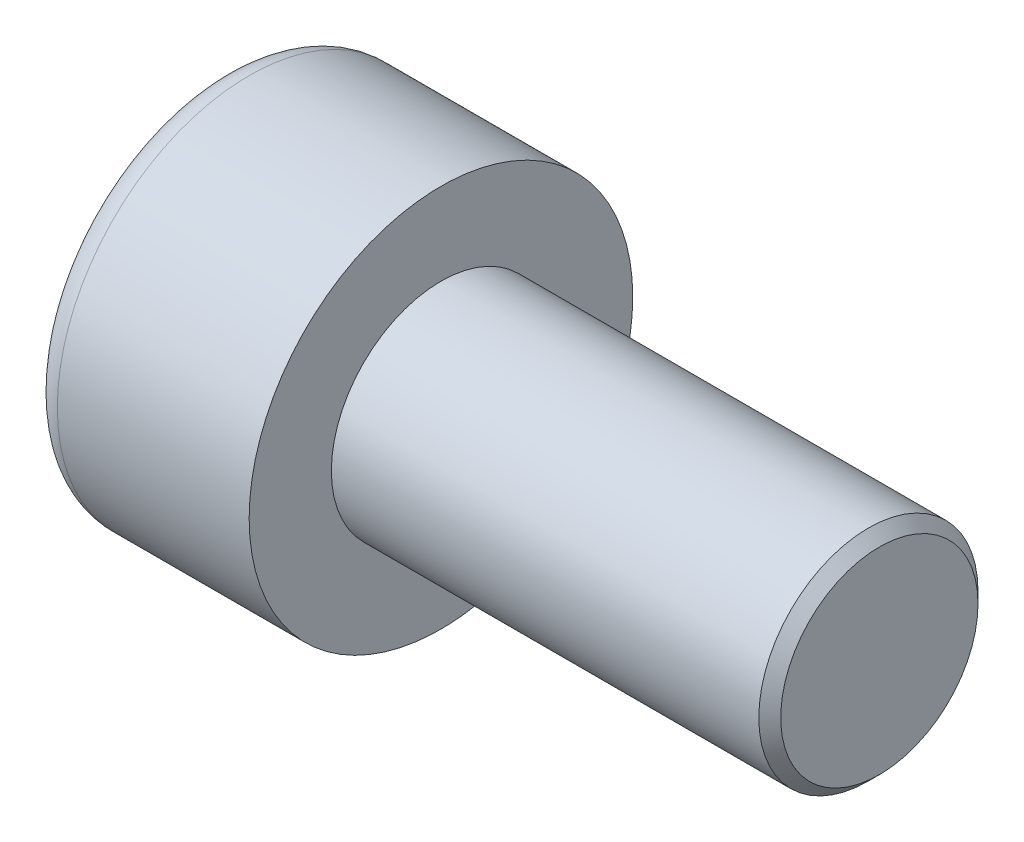
ISO-10303-21;
HEADER;
FILE_DESCRIPTION(('STEP AP214'),'2;1');
FILE_NAME('part.step','',(''),(''),'','','');
FILE_SCHEMA(('AUTOMOTIVE_DESIGN { 1 0 10303 214 1 1 1 1 }'));
ENDSEC;
DATA;
#1=APPLICATION_CONTEXT('core data for automotive mechanical design processes');
#2=APPLICATION_PROTOCOL_DEFINITION('international standard','automotive_design',2000,#1);
#3=PRODUCT_CONTEXT('',#1,'mechanical');
#4=PRODUCT('Part','Part','',(#3));
#5=PRODUCT_RELATED_PRODUCT_CATEGORY('part','',(#4));
#6=PRODUCT_DEFINITION_FORMATION('','',#4);
#7=PRODUCT_DEFINITION_CONTEXT('part definition',#1,'design');
#8=PRODUCT_DEFINITION('design','',#6,#7);
#9=PRODUCT_DEFINITION_SHAPE('','',#8);
#10=(LENGTH_UNIT() NAMED_UNIT(*) SI_UNIT(.MILLI.,.METRE.));
#11=(NAMED_UNIT(*) PLANE_ANGLE_UNIT() SI_UNIT($,.RADIAN.));
#12=(NAMED_UNIT(*) SI_UNIT($,.STERADIAN.) SOLID_ANGLE_UNIT());
#13=UNCERTAINTY_MEASURE_WITH_UNIT(LENGTH_MEASURE(1.E-05),#10,'distance_accuracy_value','');
#14=(GEOMETRIC_REPRESENTATION_CONTEXT(3) GLOBAL_UNCERTAINTY_ASSIGNED_CONTEXT((#13)) GLOBAL_UNIT_ASSIGNED_CONTEXT((#10,
#11,#12)) REPRESENTATION_CONTEXT('',''));
#15=CARTESIAN_POINT('',(0.,0.,0.));
#16=DIRECTION('',(0.,0.,1.));
#17=DIRECTION('',(1.,0.,0.));
#18=AXIS2_PLACEMENT_3D('',#15,#16,#17);
#19=CARTESIAN_POINT('',(2.,0.,-1.73205080756888));
#20=DIRECTION('',(1.,0.,0.));
#21=DIRECTION('',(0.,0.,-1.));
#22=AXIS2_PLACEMENT_3D('',#19,#20,#21);
#23=PLANE('',#22);
#24=CARTESIAN_POINT('',(2.,0.,0.));
#25=DIRECTION('',(1.,0.,0.));
#26=DIRECTION('',(0.,0.,-1.));
#27=AXIS2_PLACEMENT_3D('',#24,#25,#26);
#28=CIRCLE('',#27,1.5);
#29=CARTESIAN_POINT('',(2.,-0.75,-1.29903810567666));
#30=VERTEX_POINT('',#29);
#31=CARTESIAN_POINT('',(2.,-1.5,0.));
#32=VERTEX_POINT('',#31);
#33=EDGE_CURVE('E166',#30,#32,#28,.F.);
#34=ORIENTED_EDGE('',*,*,#33,.F.);
#35=DIRECTION('',(0.,0.866025403784439,-0.5));
#36=VECTOR('',#35,1.);
#37=CARTESIAN_POINT('',(2.,-1.5,-0.866025403784441));
#38=LINE('',#37,#36);
#39=CARTESIAN_POINT('',(2.,-1.5,-0.866025403784441));
#40=VERTEX_POINT('',#39);
#41=EDGE_CURVE('E174',#40,#30,#38,.T.);
#42=ORIENTED_EDGE('',*,*,#41,.F.);
#43=DIRECTION('',(0.,0.,-1.));
#44=VECTOR('',#43,1.);
#45=CARTESIAN_POINT('',(2.,-1.5,0.866025403784438));
#46=LINE('',#45,#44);
#47=EDGE_CURVE('E191',#32,#40,#46,.T.);
#48=ORIENTED_EDGE('',*,*,#47,.F.);
#49=EDGE_LOOP('',(#34,#42,#48));
#50=FACE_BOUND('',#49,.T.);
#51=ADVANCED_FACE('F43',(#50),#23,.F.);
#52=CARTESIAN_POINT('',(2.,-0.75,1.29903810567666));
#53=VERTEX_POINT('',#52);
#54=EDGE_CURVE('E296',#32,#53,#28,.F.);
#55=ORIENTED_EDGE('',*,*,#54,.F.);
#56=CARTESIAN_POINT('',(2.,-1.5,0.866025403784438));
#57=VERTEX_POINT('',#56);
#58=EDGE_CURVE('E192',#57,#32,#46,.T.);
#59=ORIENTED_EDGE('',*,*,#58,.F.);
#60=DIRECTION('',(0.,-0.866025403784439,-0.5));
#61=VECTOR('',#60,1.);
#62=CARTESIAN_POINT('',(2.,0.,1.73205080756888));
#63=LINE('',#62,#61);
#64=EDGE_CURVE('E187',#53,#57,#63,.T.);
#65=ORIENTED_EDGE('',*,*,#64,.F.);
#66=EDGE_LOOP('',(#55,#59,#65));
#67=FACE_BOUND('',#66,.T.);
#68=ADVANCED_FACE('F132',(#67),#23,.F.);
#69=CARTESIAN_POINT('',(2.,0.75,1.29903810567666));
#70=VERTEX_POINT('',#69);
#71=EDGE_CURVE('E292',#53,#70,#28,.F.);
#72=ORIENTED_EDGE('',*,*,#71,.F.);
#73=CARTESIAN_POINT('',(2.,0.,1.73205080756888));
#74=VERTEX_POINT('',#73);
#75=EDGE_CURVE('E188',#74,#53,#63,.T.);
#76=ORIENTED_EDGE('',*,*,#75,.F.);
#77=DIRECTION('',(0.,-0.866025403784439,0.5));
#78=VECTOR('',#77,1.);
#79=CARTESIAN_POINT('',(2.,1.5,0.866025403784439));
#80=LINE('',#79,#78);
#81=EDGE_CURVE('E183',#70,#74,#80,.T.);
#82=ORIENTED_EDGE('',*,*,#81,.F.);
#83=EDGE_LOOP('',(#72,#76,#82));
#84=FACE_BOUND('',#83,.T.);
#85=ADVANCED_FACE('F138',(#84),#23,.F.);
#86=CARTESIAN_POINT('',(2.,1.5,0.));
#87=VERTEX_POINT('',#86);
#88=EDGE_CURVE('E163',#70,#87,#28,.F.);
#89=ORIENTED_EDGE('',*,*,#88,.F.);
#90=CARTESIAN_POINT('',(2.,1.5,0.866025403784439));
#91=VERTEX_POINT('',#90);
#92=EDGE_CURVE('E184',#91,#70,#80,.T.);
#93=ORIENTED_EDGE('',*,*,#92,.F.);
#94=DIRECTION('',(0.,0.,1.));
#95=VECTOR('',#94,1.);
#96=CARTESIAN_POINT('',(2.,1.5,-0.866025403784438));
#97=LINE('',#96,#95);
#98=EDGE_CURVE('E178',#87,#91,#97,.T.);
#99=ORIENTED_EDGE('',*,*,#98,.F.);
#100=EDGE_LOOP('',(#89,#93,#99));
#101=FACE_BOUND('',#100,.T.);
#102=ADVANCED_FACE('F152',(#101),#23,.F.);
#103=CARTESIAN_POINT('',(2.,0.,0.));
#104=DIRECTION('',(1.,0.,0.));
#105=DIRECTION('',(0.,0.,-1.));
#106=AXIS2_PLACEMENT_3D('',#103,#104,#105);
#107=CIRCLE('',#106,1.5);
#108=CARTESIAN_POINT('',(2.,0.75,-1.29903810567666));
#109=VERTEX_POINT('',#108);
#110=EDGE_CURVE('E58',#109,#87,#107,.T.);
#111=ORIENTED_EDGE('',*,*,#110,.T.);
#112=CARTESIAN_POINT('',(2.,1.5,-0.866025403784438));
#113=VERTEX_POINT('',#112);
#114=EDGE_CURVE('E171',#113,#87,#97,.T.);
#115=ORIENTED_EDGE('',*,*,#114,.F.);
#116=DIRECTION('',(0.,0.866025403784438,0.5));
#117=VECTOR('',#116,1.);
#118=CARTESIAN_POINT('',(2.,0.,-1.73205080756888));
#119=LINE('',#118,#117);
#120=EDGE_CURVE('E168',#109,#113,#119,.T.);
#121=ORIENTED_EDGE('',*,*,#120,.F.);
#122=EDGE_LOOP('',(#111,#115,#121));
#123=FACE_BOUND('',#122,.T.);
#124=ADVANCED_FACE('F143',(#123),#23,.F.);
#125=EDGE_CURVE('E156',#109,#30,#28,.F.);
#126=ORIENTED_EDGE('',*,*,#125,.F.);
#127=CARTESIAN_POINT('',(2.,0.,-1.73205080756888));
#128=VERTEX_POINT('',#127);
#129=EDGE_CURVE('E159',#128,#109,#119,.T.);
#130=ORIENTED_EDGE('',*,*,#129,.F.);
#131=EDGE_CURVE('E161',#30,#128,#38,.T.);
#132=ORIENTED_EDGE('',*,*,#131,.F.);
#133=EDGE_LOOP('',(#126,#130,#132));
#134=FACE_BOUND('',#133,.T.);
#135=ADVANCED_FACE('F134',(#134),#23,.F.);
#136=CARTESIAN_POINT('',(0.,0.,0.));
#137=DIRECTION('',(1.,0.,0.));
#138=DIRECTION('',(0.,0.,-1.));
#139=AXIS2_PLACEMENT_3D('',#136,#137,#138);
#140=PLANE('',#139);
#141=CARTESIAN_POINT('',(0.,0.,0.));
#142=DIRECTION('',(1.,0.,0.));
#143=DIRECTION('',(0.,0.,-1.));
#144=AXIS2_PLACEMENT_3D('',#141,#142,#143);
#145=CIRCLE('',#144,3.);
#146=CARTESIAN_POINT('',(0.,0.,-3.));
#147=VERTEX_POINT('',#146);
#148=EDGE_CURVE('E231',#147,#147,#145,.F.);
#149=ORIENTED_EDGE('',*,*,#148,.T.);
#150=EDGE_LOOP('',(#149));
#151=FACE_BOUND('',#150,.T.);
#152=DIRECTION('',(0.,0.866025403784439,-0.5));
#153=VECTOR('',#152,1.);
#154=CARTESIAN_POINT('',(0.,-1.5,-0.866025403784441));
#155=LINE('',#154,#153);
#156=CARTESIAN_POINT('',(0.,-1.5,-0.866025403784441));
#157=VERTEX_POINT('',#156);
#158=CARTESIAN_POINT('',(0.,0.,-1.73205080756888));
#159=VERTEX_POINT('',#158);
#160=EDGE_CURVE('E66',#157,#159,#155,.T.);
#161=ORIENTED_EDGE('',*,*,#160,.T.);
#162=DIRECTION('',(0.,0.866025403784438,0.5));
#163=VECTOR('',#162,1.);
#164=CARTESIAN_POINT('',(0.,0.,-1.73205080756888));
#165=LINE('',#164,#163);
#166=CARTESIAN_POINT('',(0.,1.5,-0.866025403784438));
#167=VERTEX_POINT('',#166);
#168=EDGE_CURVE('E197',#159,#167,#165,.T.);
#169=ORIENTED_EDGE('',*,*,#168,.T.);
#170=DIRECTION('',(0.,0.,1.));
#171=VECTOR('',#170,1.);
#172=CARTESIAN_POINT('',(0.,1.5,-0.866025403784438));
#173=LINE('',#172,#171);
#174=CARTESIAN_POINT('',(0.,1.5,0.866025403784439));
#175=VERTEX_POINT('',#174);
#176=EDGE_CURVE('E200',#167,#175,#173,.T.);
#177=ORIENTED_EDGE('',*,*,#176,.T.);
#178=DIRECTION('',(0.,-0.866025403784439,0.5));
#179=VECTOR('',#178,1.);
#180=CARTESIAN_POINT('',(0.,1.5,0.866025403784439));
#181=LINE('',#180,#179);
#182=CARTESIAN_POINT('',(0.,0.,1.73205080756888));
#183=VERTEX_POINT('',#182);
#184=EDGE_CURVE('E203',#175,#183,#181,.T.);
#185=ORIENTED_EDGE('',*,*,#184,.T.);
#186=DIRECTION('',(0.,-0.866025403784439,-0.5));
#187=VECTOR('',#186,1.);
#188=CARTESIAN_POINT('',(0.,0.,1.73205080756888));
#189=LINE('',#188,#187);
#190=CARTESIAN_POINT('',(0.,-1.5,0.866025403784438));
#191=VERTEX_POINT('',#190);
#192=EDGE_CURVE('E206',#183,#191,#189,.T.);
#193=ORIENTED_EDGE('',*,*,#192,.T.);
#194=DIRECTION('',(0.,0.,-1.));
#195=VECTOR('',#194,1.);
#196=CARTESIAN_POINT('',(0.,-1.5,0.866025403784438));
#197=LINE('',#196,#195);
#198=EDGE_CURVE('E209',#191,#157,#197,.T.);
#199=ORIENTED_EDGE('',*,*,#198,.T.);
#200=EDGE_LOOP('',(#161,#169,#177,#185,#193,#199));
#201=FACE_BOUND('',#200,.T.);
#202=ADVANCED_FACE('F142',(#151,#201),#140,.F.);
#203=CARTESIAN_POINT('',(4.,0.,0.));
#204=DIRECTION('',(1.,0.,0.));
#205=DIRECTION('',(0.,0.,-1.));
#206=AXIS2_PLACEMENT_3D('',#203,#204,#205);
#207=PLANE('',#206);
#208=CARTESIAN_POINT('',(4.,0.,0.));
#209=DIRECTION('',(1.,0.,0.));
#210=DIRECTION('',(0.,0.,-1.));
#211=AXIS2_PLACEMENT_3D('',#208,#209,#210);
#212=CIRCLE('',#211,3.5);
#213=CARTESIAN_POINT('',(4.,0.,-3.5));
#214=VERTEX_POINT('',#213);
#215=EDGE_CURVE('E164',#214,#214,#212,.T.);
#216=ORIENTED_EDGE('',*,*,#215,.T.);
#217=EDGE_LOOP('',(#216));
#218=FACE_BOUND('',#217,.T.);
#219=CARTESIAN_POINT('',(4.,0.,0.));
#220=DIRECTION('',(1.,0.,0.));
#221=DIRECTION('',(0.,0.,-1.));
#222=AXIS2_PLACEMENT_3D('',#219,#220,#221);
#223=CIRCLE('',#222,2.);
#224=CARTESIAN_POINT('',(4.,0.,-2.));
#225=VERTEX_POINT('',#224);
#226=EDGE_CURVE('E222',#225,#225,#223,.T.);
#227=ORIENTED_EDGE('',*,*,#226,.F.);
#228=EDGE_LOOP('',(#227));
#229=FACE_BOUND('',#228,.T.);
#230=ADVANCED_FACE('F149',(#218,#229),#207,.T.);
#231=CARTESIAN_POINT('',(4.,0.,0.));
#232=DIRECTION('',(-1.,0.,0.));
#233=DIRECTION('',(0.,0.,1.));
#234=AXIS2_PLACEMENT_3D('',#231,#232,#233);
#235=CYLINDRICAL_SURFACE('',#234,3.5);
#236=CARTESIAN_POINT('',(0.5,0.,0.));
#237=DIRECTION('',(1.,0.,0.));
#238=DIRECTION('',(0.,0.,-1.));
#239=AXIS2_PLACEMENT_3D('',#236,#237,#238);
#240=CIRCLE('',#239,3.5);
#241=CARTESIAN_POINT('',(0.5,0.,-3.5));
#242=VERTEX_POINT('',#241);
#243=EDGE_CURVE('E228',#242,#242,#240,.T.);
#244=ORIENTED_EDGE('',*,*,#243,.T.);
#245=EDGE_LOOP('',(#244));
#246=FACE_BOUND('',#245,.T.);
#247=ORIENTED_EDGE('',*,*,#215,.F.);
#248=EDGE_LOOP('',(#247));
#249=FACE_BOUND('',#248,.T.);
#250=ADVANCED_FACE('F247',(#246,#249),#235,.T.);
#251=CARTESIAN_POINT('',(12.,0.,0.));
#252=DIRECTION('',(-1.,0.,0.));
#253=DIRECTION('',(0.,0.,1.));
#254=AXIS2_PLACEMENT_3D('',#251,#252,#253);
#255=CYLINDRICAL_SURFACE('',#254,2.);
#256=CARTESIAN_POINT('',(11.8,0.,0.));
#257=DIRECTION('',(1.,0.,0.));
#258=DIRECTION('',(0.,0.,-1.));
#259=AXIS2_PLACEMENT_3D('',#256,#257,#258);
#260=CIRCLE('',#259,2.);
#261=CARTESIAN_POINT('',(11.8,0.,-2.));
#262=VERTEX_POINT('',#261);
#263=EDGE_CURVE('E11',#262,#262,#260,.F.);
#264=ORIENTED_EDGE('',*,*,#263,.T.);
#265=EDGE_LOOP('',(#264));
#266=FACE_BOUND('',#265,.T.);
#267=ORIENTED_EDGE('',*,*,#226,.T.);
#268=EDGE_LOOP('',(#267));
#269=FACE_BOUND('',#268,.T.);
#270=ADVANCED_FACE('F244',(#266,#269),#255,.T.);
#271=CARTESIAN_POINT('',(12.,0.,0.));
#272=DIRECTION('',(1.,0.,0.));
#273=DIRECTION('',(0.,0.,-1.));
#274=AXIS2_PLACEMENT_3D('',#271,#272,#273);
#275=PLANE('',#274);
#276=CARTESIAN_POINT('',(12.,0.,0.));
#277=DIRECTION('',(1.,0.,0.));
#278=DIRECTION('',(0.,0.,-1.));
#279=AXIS2_PLACEMENT_3D('',#276,#277,#278);
#280=CIRCLE('',#279,1.8);
#281=CARTESIAN_POINT('',(12.,0.,-1.8));
#282=VERTEX_POINT('',#281);
#283=EDGE_CURVE('E51',#282,#282,#280,.T.);
#284=ORIENTED_EDGE('',*,*,#283,.T.);
#285=EDGE_LOOP('',(#284));
#286=FACE_BOUND('',#285,.T.);
#287=ADVANCED_FACE('F236',(#286),#275,.T.);
#288=CARTESIAN_POINT('',(2.,-1.5,-0.866025403784441));
#289=DIRECTION('',(0.,0.5,0.866025403784439));
#290=DIRECTION('',(0.,-0.866025403784439,0.5));
#291=AXIS2_PLACEMENT_3D('',#288,#289,#290);
#292=PLANE('',#291);
#293=ORIENTED_EDGE('',*,*,#160,.F.);
#294=DIRECTION('',(-1.,0.,0.));
#295=VECTOR('',#294,1.);
#296=CARTESIAN_POINT('',(2.,-1.5,-0.866025403784441));
#297=LINE('',#296,#295);
#298=EDGE_CURVE('E195',#40,#157,#297,.T.);
#299=ORIENTED_EDGE('',*,*,#298,.F.);
#300=ORIENTED_EDGE('',*,*,#41,.T.);
#301=ORIENTED_EDGE('',*,*,#131,.T.);
#302=DIRECTION('',(-1.,0.,0.));
#303=VECTOR('',#302,1.);
#304=CARTESIAN_POINT('',(2.,0.,-1.73205080756888));
#305=LINE('',#304,#303);
#306=EDGE_CURVE('E177',#128,#159,#305,.T.);
#307=ORIENTED_EDGE('',*,*,#306,.T.);
#308=EDGE_LOOP('',(#293,#299,#300,#301,#307));
#309=FACE_BOUND('',#308,.T.);
#310=ADVANCED_FACE('F262',(#309),#292,.T.);
#311=CARTESIAN_POINT('',(2.,0.,-1.73205080756888));
#312=DIRECTION('',(0.,-0.5,0.866025403784438));
#313=DIRECTION('',(0.,-0.866025403784438,-0.5));
#314=AXIS2_PLACEMENT_3D('',#311,#312,#313);
#315=PLANE('',#314);
#316=ORIENTED_EDGE('',*,*,#168,.F.);
#317=ORIENTED_EDGE('',*,*,#306,.F.);
#318=ORIENTED_EDGE('',*,*,#129,.T.);
#319=ORIENTED_EDGE('',*,*,#120,.T.);
#320=DIRECTION('',(-1.,0.,0.));
#321=VECTOR('',#320,1.);
#322=CARTESIAN_POINT('',(2.,1.5,-0.866025403784438));
#323=LINE('',#322,#321);
#324=EDGE_CURVE('E219',#113,#167,#323,.T.);
#325=ORIENTED_EDGE('',*,*,#324,.T.);
#326=EDGE_LOOP('',(#316,#317,#318,#319,#325));
#327=FACE_BOUND('',#326,.T.);
#328=ADVANCED_FACE('F176',(#327),#315,.T.);
#329=CARTESIAN_POINT('',(2.,1.5,-0.866025403784438));
#330=DIRECTION('',(0.,-1.,0.));
#331=DIRECTION('',(0.,0.,-1.));
#332=AXIS2_PLACEMENT_3D('',#329,#330,#331);
#333=PLANE('',#332);
#334=ORIENTED_EDGE('',*,*,#176,.F.);
#335=ORIENTED_EDGE('',*,*,#324,.F.);
#336=ORIENTED_EDGE('',*,*,#114,.T.);
#337=ORIENTED_EDGE('',*,*,#98,.T.);
#338=DIRECTION('',(-1.,0.,0.));
#339=VECTOR('',#338,1.);
#340=CARTESIAN_POINT('',(2.,1.5,0.866025403784439));
#341=LINE('',#340,#339);
#342=EDGE_CURVE('E217',#91,#175,#341,.T.);
#343=ORIENTED_EDGE('',*,*,#342,.T.);
#344=EDGE_LOOP('',(#334,#335,#336,#337,#343));
#345=FACE_BOUND('',#344,.T.);
#346=ADVANCED_FACE('F267',(#345),#333,.T.);
#347=CARTESIAN_POINT('',(2.,1.5,0.866025403784439));
#348=DIRECTION('',(0.,-0.5,-0.866025403784439));
#349=DIRECTION('',(0.,0.866025403784439,-0.5));
#350=AXIS2_PLACEMENT_3D('',#347,#348,#349);
#351=PLANE('',#350);
#352=ORIENTED_EDGE('',*,*,#184,.F.);
#353=ORIENTED_EDGE('',*,*,#342,.F.);
#354=ORIENTED_EDGE('',*,*,#92,.T.);
#355=ORIENTED_EDGE('',*,*,#81,.T.);
#356=DIRECTION('',(-1.,0.,0.));
#357=VECTOR('',#356,1.);
#358=CARTESIAN_POINT('',(2.,0.,1.73205080756888));
#359=LINE('',#358,#357);
#360=EDGE_CURVE('E215',#74,#183,#359,.T.);
#361=ORIENTED_EDGE('',*,*,#360,.T.);
#362=EDGE_LOOP('',(#352,#353,#354,#355,#361));
#363=FACE_BOUND('',#362,.T.);
#364=ADVANCED_FACE('F270',(#363),#351,.T.);
#365=CARTESIAN_POINT('',(2.,0.,1.73205080756888));
#366=DIRECTION('',(0.,0.5,-0.866025403784439));
#367=DIRECTION('',(0.,0.866025403784439,0.5));
#368=AXIS2_PLACEMENT_3D('',#365,#366,#367);
#369=PLANE('',#368);
#370=ORIENTED_EDGE('',*,*,#192,.F.);
#371=ORIENTED_EDGE('',*,*,#360,.F.);
#372=ORIENTED_EDGE('',*,*,#75,.T.);
#373=ORIENTED_EDGE('',*,*,#64,.T.);
#374=DIRECTION('',(-1.,0.,0.));
#375=VECTOR('',#374,1.);
#376=CARTESIAN_POINT('',(2.,-1.5,0.866025403784438));
#377=LINE('',#376,#375);
#378=EDGE_CURVE('E213',#57,#191,#377,.T.);
#379=ORIENTED_EDGE('',*,*,#378,.T.);
#380=EDGE_LOOP('',(#370,#371,#372,#373,#379));
#381=FACE_BOUND('',#380,.T.);
#382=ADVANCED_FACE('F127',(#381),#369,.T.);
#383=CARTESIAN_POINT('',(2.,-1.5,0.866025403784438));
#384=DIRECTION('',(0.,1.,0.));
#385=DIRECTION('',(0.,0.,1.));
#386=AXIS2_PLACEMENT_3D('',#383,#384,#385);
#387=PLANE('',#386);
#388=ORIENTED_EDGE('',*,*,#198,.F.);
#389=ORIENTED_EDGE('',*,*,#378,.F.);
#390=ORIENTED_EDGE('',*,*,#58,.T.);
#391=ORIENTED_EDGE('',*,*,#47,.T.);
#392=ORIENTED_EDGE('',*,*,#298,.T.);
#393=EDGE_LOOP('',(#388,#389,#390,#391,#392));
#394=FACE_BOUND('',#393,.T.);
#395=ADVANCED_FACE('F120',(#394),#387,.T.);
#396=CARTESIAN_POINT('',(2.,0.,0.));
#397=DIRECTION('',(-1.,0.,0.));
#398=DIRECTION('',(0.,0.,1.));
#399=AXIS2_PLACEMENT_3D('',#396,#397,#398);
#400=CONICAL_SURFACE('',#399,1.5,1.04719755119659);
#401=CARTESIAN_POINT('',(2.86602540378445,0.,0.));
#402=VERTEX_POINT('',#401);
#403=VERTEX_LOOP('',#402);
#404=FACE_BOUND('',#403,.T.);
#405=ORIENTED_EDGE('',*,*,#110,.F.);
#406=ORIENTED_EDGE('',*,*,#125,.T.);
#407=ORIENTED_EDGE('',*,*,#33,.T.);
#408=ORIENTED_EDGE('',*,*,#54,.T.);
#409=ORIENTED_EDGE('',*,*,#71,.T.);
#410=ORIENTED_EDGE('',*,*,#88,.T.);
#411=EDGE_LOOP('',(#405,#406,#407,#408,#409,#410));
#412=FACE_BOUND('',#411,.T.);
#413=ADVANCED_FACE('F117',(#404,#412),#400,.F.);
#414=CARTESIAN_POINT('',(0.5,0.,0.));
#415=DIRECTION('',(1.,0.,0.));
#416=DIRECTION('',(0.,0.,-1.));
#417=AXIS2_PLACEMENT_3D('',#414,#415,#416);
#418=TOROIDAL_SURFACE('',#417,3.,0.5);
#419=ORIENTED_EDGE('',*,*,#148,.F.);
#420=EDGE_LOOP('',(#419));
#421=FACE_BOUND('',#420,.T.);
#422=ORIENTED_EDGE('',*,*,#243,.F.);
#423=EDGE_LOOP('',(#422));
#424=FACE_BOUND('',#423,.T.);
#425=ADVANCED_FACE('F119',(#421,#424),#418,.T.);
#426=CARTESIAN_POINT('',(12.,0.,0.));
#427=DIRECTION('',(-1.,0.,0.));
#428=DIRECTION('',(0.,0.,1.));
#429=AXIS2_PLACEMENT_3D('',#426,#427,#428);
#430=CONICAL_SURFACE('',#429,1.8,0.785398163397448);
#431=ORIENTED_EDGE('',*,*,#263,.F.);
#432=EDGE_LOOP('',(#431));
#433=FACE_BOUND('',#432,.T.);
#434=ORIENTED_EDGE('',*,*,#283,.F.);
#435=EDGE_LOOP('',(#434));
#436=FACE_BOUND('',#435,.T.);
#437=ADVANCED_FACE('F45',(#433,#436),#430,.T.);
#438=CLOSED_SHELL('',(#51,#68,#85,#102,#124,#135,#202,#230,#250,#270,#287,#310,#328,#346,#364,
#382,#395,#413,#425,#437));
#439=MANIFOLD_SOLID_BREP('B2',#438);
#440=ADVANCED_BREP_SHAPE_REPRESENTATION('',(#18,#439),#14);
#441=SHAPE_DEFINITION_REPRESENTATION(#9,#440);
ENDSEC;
END-ISO-10303-21;
